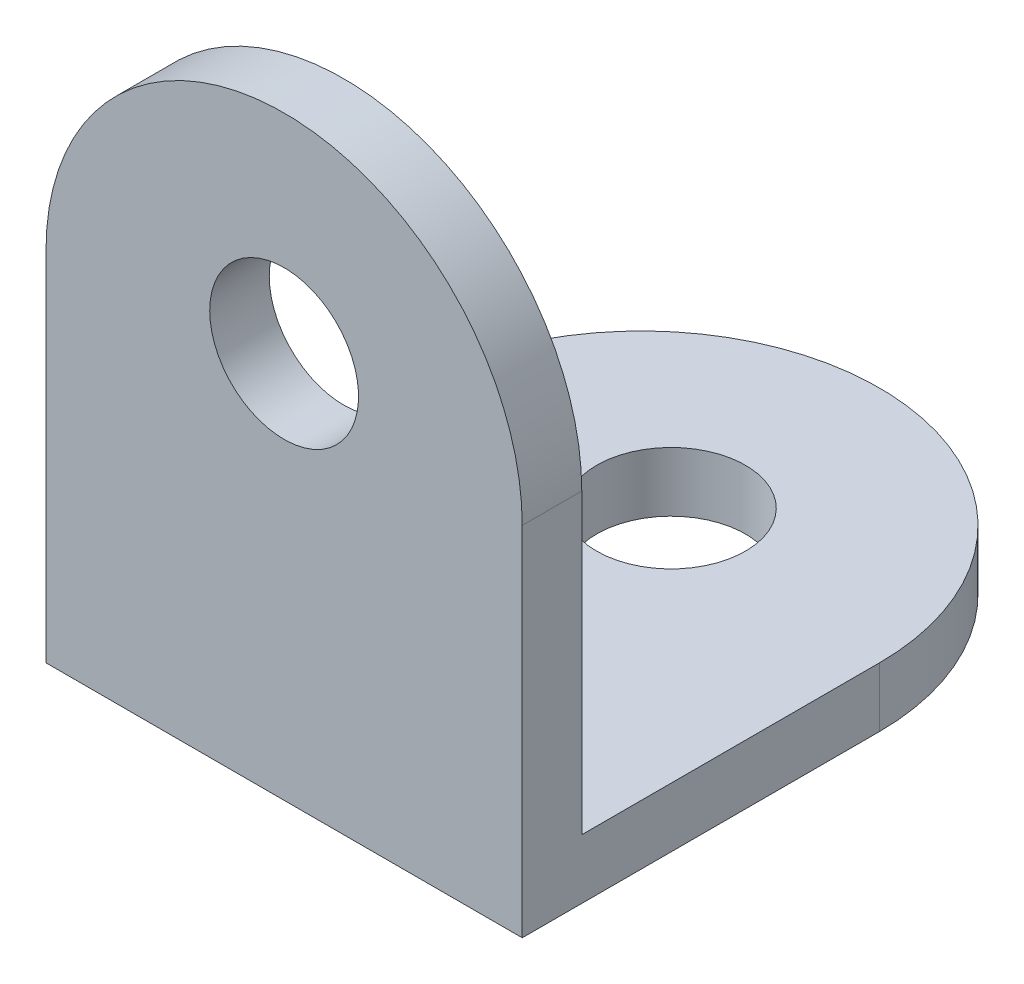
ISO-10303-21;
HEADER;
FILE_DESCRIPTION(('STEP AP214'),'2;1');
FILE_NAME('part.step','',(''),(''),'','','');
FILE_SCHEMA(('AUTOMOTIVE_DESIGN { 1 0 10303 214 1 1 1 1 }'));
ENDSEC;
DATA;
#1=APPLICATION_CONTEXT('core data for automotive mechanical design processes');
#2=APPLICATION_PROTOCOL_DEFINITION('international standard','automotive_design',2000,#1);
#3=PRODUCT_CONTEXT('',#1,'mechanical');
#4=PRODUCT('Part','Part','',(#3));
#5=PRODUCT_RELATED_PRODUCT_CATEGORY('part','',(#4));
#6=PRODUCT_DEFINITION_FORMATION('','',#4);
#7=PRODUCT_DEFINITION_CONTEXT('part definition',#1,'design');
#8=PRODUCT_DEFINITION('design','',#6,#7);
#9=PRODUCT_DEFINITION_SHAPE('','',#8);
#10=(LENGTH_UNIT() NAMED_UNIT(*) SI_UNIT(.MILLI.,.METRE.));
#11=(NAMED_UNIT(*) PLANE_ANGLE_UNIT() SI_UNIT($,.RADIAN.));
#12=(NAMED_UNIT(*) SI_UNIT($,.STERADIAN.) SOLID_ANGLE_UNIT());
#13=UNCERTAINTY_MEASURE_WITH_UNIT(LENGTH_MEASURE(1.E-05),#10,'distance_accuracy_value','');
#14=(GEOMETRIC_REPRESENTATION_CONTEXT(3) GLOBAL_UNCERTAINTY_ASSIGNED_CONTEXT((#13)) GLOBAL_UNIT_ASSIGNED_CONTEXT((#10,
#11,#12)) REPRESENTATION_CONTEXT('',''));
#15=CARTESIAN_POINT('',(0.,0.,0.));
#16=DIRECTION('',(0.,0.,1.));
#17=DIRECTION('',(1.,0.,0.));
#18=AXIS2_PLACEMENT_3D('',#15,#16,#17);
#19=CARTESIAN_POINT('',(0.,2.,-13.4238536666092));
#20=DIRECTION('',(0.,-1.,0.));
#21=DIRECTION('',(0.,0.,-1.));
#22=AXIS2_PLACEMENT_3D('',#19,#20,#21);
#23=CYLINDRICAL_SURFACE('',#22,8.);
#24=CARTESIAN_POINT('',(0.,0.,-13.4238536666092));
#25=DIRECTION('',(0.,1.,0.));
#26=DIRECTION('',(0.,0.,1.));
#27=AXIS2_PLACEMENT_3D('',#24,#25,#26);
#28=CIRCLE('',#27,8.);
#29=CARTESIAN_POINT('',(8.,0.,-13.4238536666092));
#30=VERTEX_POINT('',#29);
#31=CARTESIAN_POINT('',(-8.,0.,-13.4238536666092));
#32=VERTEX_POINT('',#31);
#33=EDGE_CURVE('E101',#30,#32,#28,.T.);
#34=ORIENTED_EDGE('',*,*,#33,.T.);
#35=DIRECTION('',(0.,-1.,0.));
#36=VECTOR('',#35,1.);
#37=CARTESIAN_POINT('',(-8.,2.,-13.4238536666092));
#38=LINE('',#37,#36);
#39=CARTESIAN_POINT('',(-8.,2.,-13.4238536666092));
#40=VERTEX_POINT('',#39);
#41=EDGE_CURVE('E11',#40,#32,#38,.T.);
#42=ORIENTED_EDGE('',*,*,#41,.F.);
#43=CARTESIAN_POINT('',(0.,2.,-13.4238536666092));
#44=DIRECTION('',(0.,1.,0.));
#45=DIRECTION('',(0.,0.,1.));
#46=AXIS2_PLACEMENT_3D('',#43,#44,#45);
#47=CIRCLE('',#46,8.);
#48=CARTESIAN_POINT('',(8.,2.,-13.4238536666092));
#49=VERTEX_POINT('',#48);
#50=EDGE_CURVE('E95',#49,#40,#47,.T.);
#51=ORIENTED_EDGE('',*,*,#50,.F.);
#52=DIRECTION('',(0.,-1.,0.));
#53=VECTOR('',#52,1.);
#54=CARTESIAN_POINT('',(8.,2.,-13.4238536666092));
#55=LINE('',#54,#53);
#56=EDGE_CURVE('E86',#49,#30,#55,.T.);
#57=ORIENTED_EDGE('',*,*,#56,.T.);
#58=EDGE_LOOP('',(#34,#42,#51,#57));
#59=FACE_BOUND('',#58,.T.);
#60=ADVANCED_FACE('F43',(#59),#23,.T.);
#61=CARTESIAN_POINT('',(-8.,2.,-1.42385366660922));
#62=DIRECTION('',(1.,0.,0.));
#63=DIRECTION('',(0.,0.,-1.));
#64=AXIS2_PLACEMENT_3D('',#61,#62,#63);
#65=PLANE('',#64);
#66=DIRECTION('',(0.,0.,1.));
#67=VECTOR('',#66,1.);
#68=CARTESIAN_POINT('',(-8.,0.,-1.42385366660922));
#69=LINE('',#68,#67);
#70=CARTESIAN_POINT('',(-8.,0.,-1.42385366660922));
#71=VERTEX_POINT('',#70);
#72=EDGE_CURVE('E105',#32,#71,#69,.T.);
#73=ORIENTED_EDGE('',*,*,#72,.T.);
#74=DIRECTION('',(0.,-1.,0.));
#75=VECTOR('',#74,1.);
#76=CARTESIAN_POINT('',(-8.,2.,-1.42385366660922));
#77=LINE('',#76,#75);
#78=CARTESIAN_POINT('',(-8.,12.,-1.42385366660922));
#79=VERTEX_POINT('',#78);
#80=EDGE_CURVE('E51',#79,#71,#77,.T.);
#81=ORIENTED_EDGE('',*,*,#80,.F.);
#82=DIRECTION('',(0.,0.,1.));
#83=VECTOR('',#82,1.);
#84=CARTESIAN_POINT('',(-8.,12.,-3.42385366660922));
#85=LINE('',#84,#83);
#86=CARTESIAN_POINT('',(-8.,12.,-3.42385366660922));
#87=VERTEX_POINT('',#86);
#88=EDGE_CURVE('E136',#87,#79,#85,.T.);
#89=ORIENTED_EDGE('',*,*,#88,.F.);
#90=DIRECTION('',(0.,-1.,0.));
#91=VECTOR('',#90,1.);
#92=CARTESIAN_POINT('',(-8.,12.,-3.42385366660922));
#93=LINE('',#92,#91);
#94=CARTESIAN_POINT('',(-8.,2.,-3.42385366660922));
#95=VERTEX_POINT('',#94);
#96=EDGE_CURVE('E113',#87,#95,#93,.T.);
#97=ORIENTED_EDGE('',*,*,#96,.T.);
#98=DIRECTION('',(0.,0.,1.));
#99=VECTOR('',#98,1.);
#100=CARTESIAN_POINT('',(-8.,2.,-1.42385366660922));
#101=LINE('',#100,#99);
#102=EDGE_CURVE('E160',#40,#95,#101,.T.);
#103=ORIENTED_EDGE('',*,*,#102,.F.);
#104=ORIENTED_EDGE('',*,*,#41,.T.);
#105=EDGE_LOOP('',(#73,#81,#89,#97,#103,#104));
#106=FACE_BOUND('',#105,.T.);
#107=ADVANCED_FACE('F133',(#106),#65,.F.);
#108=CARTESIAN_POINT('',(8.,2.,-1.42385366660922));
#109=DIRECTION('',(0.,0.,-1.));
#110=DIRECTION('',(-1.,0.,0.));
#111=AXIS2_PLACEMENT_3D('',#108,#109,#110);
#112=PLANE('',#111);
#113=CARTESIAN_POINT('',(0.,13.,-1.42385366660922));
#114=DIRECTION('',(0.,0.,-1.));
#115=DIRECTION('',(-1.,0.,0.));
#116=AXIS2_PLACEMENT_3D('',#113,#114,#115);
#117=CIRCLE('',#116,2.5);
#118=CARTESIAN_POINT('',(-2.5,13.,-1.42385366660922));
#119=VERTEX_POINT('',#118);
#120=EDGE_CURVE('E181',#119,#119,#117,.T.);
#121=ORIENTED_EDGE('',*,*,#120,.T.);
#122=EDGE_LOOP('',(#121));
#123=FACE_BOUND('',#122,.T.);
#124=DIRECTION('',(1.,0.,0.));
#125=VECTOR('',#124,1.);
#126=CARTESIAN_POINT('',(8.,0.,-1.42385366660922));
#127=LINE('',#126,#125);
#128=CARTESIAN_POINT('',(8.,0.,-1.42385366660922));
#129=VERTEX_POINT('',#128);
#130=EDGE_CURVE('E96',#71,#129,#127,.T.);
#131=ORIENTED_EDGE('',*,*,#130,.T.);
#132=DIRECTION('',(0.,-1.,0.));
#133=VECTOR('',#132,1.);
#134=CARTESIAN_POINT('',(8.,2.,-1.42385366660922));
#135=LINE('',#134,#133);
#136=CARTESIAN_POINT('',(8.,12.,-1.42385366660922));
#137=VERTEX_POINT('',#136);
#138=EDGE_CURVE('E90',#137,#129,#135,.T.);
#139=ORIENTED_EDGE('',*,*,#138,.F.);
#140=CARTESIAN_POINT('',(0.,12.,-1.42385366660922));
#141=DIRECTION('',(0.,0.,-1.));
#142=DIRECTION('',(-1.,0.,0.));
#143=AXIS2_PLACEMENT_3D('',#140,#141,#142);
#144=CIRCLE('',#143,8.);
#145=EDGE_CURVE('E129',#79,#137,#144,.T.);
#146=ORIENTED_EDGE('',*,*,#145,.F.);
#147=ORIENTED_EDGE('',*,*,#80,.T.);
#148=EDGE_LOOP('',(#131,#139,#146,#147));
#149=FACE_BOUND('',#148,.T.);
#150=ADVANCED_FACE('F126',(#123,#149),#112,.F.);
#151=CARTESIAN_POINT('',(8.,2.,-1.42385366660922));
#152=DIRECTION('',(-1.,0.,0.));
#153=DIRECTION('',(0.,0.,1.));
#154=AXIS2_PLACEMENT_3D('',#151,#152,#153);
#155=PLANE('',#154);
#156=DIRECTION('',(0.,0.,-1.));
#157=VECTOR('',#156,1.);
#158=CARTESIAN_POINT('',(8.,0.,-1.42385366660922));
#159=LINE('',#158,#157);
#160=EDGE_CURVE('E83',#129,#30,#159,.T.);
#161=ORIENTED_EDGE('',*,*,#160,.T.);
#162=ORIENTED_EDGE('',*,*,#56,.F.);
#163=DIRECTION('',(0.,0.,-1.));
#164=VECTOR('',#163,1.);
#165=CARTESIAN_POINT('',(8.,2.,-1.42385366660922));
#166=LINE('',#165,#164);
#167=CARTESIAN_POINT('',(8.,2.,-3.42385366660922));
#168=VERTEX_POINT('',#167);
#169=EDGE_CURVE('E63',#168,#49,#166,.T.);
#170=ORIENTED_EDGE('',*,*,#169,.F.);
#171=DIRECTION('',(0.,-1.,0.));
#172=VECTOR('',#171,1.);
#173=CARTESIAN_POINT('',(8.,12.,-3.42385366660922));
#174=LINE('',#173,#172);
#175=CARTESIAN_POINT('',(8.,12.,-3.42385366660922));
#176=VERTEX_POINT('',#175);
#177=EDGE_CURVE('E107',#176,#168,#174,.T.);
#178=ORIENTED_EDGE('',*,*,#177,.F.);
#179=DIRECTION('',(0.,0.,-1.));
#180=VECTOR('',#179,1.);
#181=CARTESIAN_POINT('',(8.,12.,-1.42385366660922));
#182=LINE('',#181,#180);
#183=EDGE_CURVE('E148',#137,#176,#182,.T.);
#184=ORIENTED_EDGE('',*,*,#183,.F.);
#185=ORIENTED_EDGE('',*,*,#138,.T.);
#186=EDGE_LOOP('',(#161,#162,#170,#178,#184,#185));
#187=FACE_BOUND('',#186,.T.);
#188=ADVANCED_FACE('F85',(#187),#155,.F.);
#189=CARTESIAN_POINT('',(0.,2.,-13.4238536666092));
#190=DIRECTION('',(0.,1.,0.));
#191=DIRECTION('',(0.,0.,1.));
#192=AXIS2_PLACEMENT_3D('',#189,#190,#191);
#193=PLANE('',#192);
#194=CARTESIAN_POINT('',(0.,2.,-14.4238536666092));
#195=DIRECTION('',(0.,1.,0.));
#196=DIRECTION('',(0.,0.,1.));
#197=AXIS2_PLACEMENT_3D('',#194,#195,#196);
#198=CIRCLE('',#197,2.5);
#199=CARTESIAN_POINT('',(0.,2.,-11.9238536666092));
#200=VERTEX_POINT('',#199);
#201=EDGE_CURVE('E175',#200,#200,#198,.T.);
#202=ORIENTED_EDGE('',*,*,#201,.F.);
#203=EDGE_LOOP('',(#202));
#204=FACE_BOUND('',#203,.T.);
#205=DIRECTION('',(-1.,0.,0.));
#206=VECTOR('',#205,1.);
#207=CARTESIAN_POINT('',(8.,2.,-3.42385366660922));
#208=LINE('',#207,#206);
#209=EDGE_CURVE('E58',#168,#95,#208,.T.);
#210=ORIENTED_EDGE('',*,*,#209,.F.);
#211=ORIENTED_EDGE('',*,*,#169,.T.);
#212=ORIENTED_EDGE('',*,*,#50,.T.);
#213=ORIENTED_EDGE('',*,*,#102,.T.);
#214=EDGE_LOOP('',(#210,#211,#212,#213));
#215=FACE_BOUND('',#214,.T.);
#216=ADVANCED_FACE('F163',(#204,#215),#193,.T.);
#217=CARTESIAN_POINT('',(0.,0.,-13.4238536666092));
#218=DIRECTION('',(0.,1.,0.));
#219=DIRECTION('',(0.,0.,1.));
#220=AXIS2_PLACEMENT_3D('',#217,#218,#219);
#221=PLANE('',#220);
#222=CARTESIAN_POINT('',(0.,0.,-14.4238536666092));
#223=DIRECTION('',(0.,1.,0.));
#224=DIRECTION('',(0.,0.,1.));
#225=AXIS2_PLACEMENT_3D('',#222,#223,#224);
#226=CIRCLE('',#225,2.5);
#227=CARTESIAN_POINT('',(0.,0.,-11.9238536666092));
#228=VERTEX_POINT('',#227);
#229=EDGE_CURVE('E171',#228,#228,#226,.T.);
#230=ORIENTED_EDGE('',*,*,#229,.T.);
#231=EDGE_LOOP('',(#230));
#232=FACE_BOUND('',#231,.T.);
#233=ORIENTED_EDGE('',*,*,#33,.F.);
#234=ORIENTED_EDGE('',*,*,#160,.F.);
#235=ORIENTED_EDGE('',*,*,#130,.F.);
#236=ORIENTED_EDGE('',*,*,#72,.F.);
#237=EDGE_LOOP('',(#233,#234,#235,#236));
#238=FACE_BOUND('',#237,.T.);
#239=ADVANCED_FACE('F104',(#232,#238),#221,.F.);
#240=CARTESIAN_POINT('',(8.,12.,-3.42385366660922));
#241=DIRECTION('',(0.,0.,1.));
#242=DIRECTION('',(1.,0.,0.));
#243=AXIS2_PLACEMENT_3D('',#240,#241,#242);
#244=PLANE('',#243);
#245=CARTESIAN_POINT('',(0.,13.,-3.42385366660922));
#246=DIRECTION('',(0.,0.,-1.));
#247=DIRECTION('',(-1.,0.,0.));
#248=AXIS2_PLACEMENT_3D('',#245,#246,#247);
#249=CIRCLE('',#248,2.5);
#250=CARTESIAN_POINT('',(-2.5,13.,-3.42385366660922));
#251=VERTEX_POINT('',#250);
#252=EDGE_CURVE('E184',#251,#251,#249,.T.);
#253=ORIENTED_EDGE('',*,*,#252,.F.);
#254=EDGE_LOOP('',(#253));
#255=FACE_BOUND('',#254,.T.);
#256=ORIENTED_EDGE('',*,*,#209,.T.);
#257=ORIENTED_EDGE('',*,*,#96,.F.);
#258=CARTESIAN_POINT('',(0.,12.,-3.42385366660922));
#259=DIRECTION('',(0.,0.,-1.));
#260=DIRECTION('',(-1.,0.,0.));
#261=AXIS2_PLACEMENT_3D('',#258,#259,#260);
#262=CIRCLE('',#261,8.);
#263=EDGE_CURVE('E146',#87,#176,#262,.T.);
#264=ORIENTED_EDGE('',*,*,#263,.T.);
#265=ORIENTED_EDGE('',*,*,#177,.T.);
#266=EDGE_LOOP('',(#256,#257,#264,#265));
#267=FACE_BOUND('',#266,.T.);
#268=ADVANCED_FACE('F165',(#255,#267),#244,.F.);
#269=CARTESIAN_POINT('',(0.,12.,-1.42385366660922));
#270=DIRECTION('',(0.,0.,-1.));
#271=DIRECTION('',(-1.,0.,0.));
#272=AXIS2_PLACEMENT_3D('',#269,#270,#271);
#273=CYLINDRICAL_SURFACE('',#272,8.);
#274=ORIENTED_EDGE('',*,*,#263,.F.);
#275=ORIENTED_EDGE('',*,*,#88,.T.);
#276=ORIENTED_EDGE('',*,*,#145,.T.);
#277=ORIENTED_EDGE('',*,*,#183,.T.);
#278=EDGE_LOOP('',(#274,#275,#276,#277));
#279=FACE_BOUND('',#278,.T.);
#280=ADVANCED_FACE('F143',(#279),#273,.T.);
#281=CARTESIAN_POINT('',(0.,0.,-14.4238536666092));
#282=DIRECTION('',(0.,1.,0.));
#283=DIRECTION('',(0.,0.,1.));
#284=AXIS2_PLACEMENT_3D('',#281,#282,#283);
#285=CYLINDRICAL_SURFACE('',#284,2.5);
#286=ORIENTED_EDGE('',*,*,#229,.F.);
#287=EDGE_LOOP('',(#286));
#288=FACE_BOUND('',#287,.T.);
#289=ORIENTED_EDGE('',*,*,#201,.T.);
#290=EDGE_LOOP('',(#289));
#291=FACE_BOUND('',#290,.T.);
#292=ADVANCED_FACE('F196',(#288,#291),#285,.F.);
#293=CARTESIAN_POINT('',(0.,13.,-1.42385366660922));
#294=DIRECTION('',(0.,0.,-1.));
#295=DIRECTION('',(-1.,0.,0.));
#296=AXIS2_PLACEMENT_3D('',#293,#294,#295);
#297=CYLINDRICAL_SURFACE('',#296,2.5);
#298=ORIENTED_EDGE('',*,*,#120,.F.);
#299=EDGE_LOOP('',(#298));
#300=FACE_BOUND('',#299,.T.);
#301=ORIENTED_EDGE('',*,*,#252,.T.);
#302=EDGE_LOOP('',(#301));
#303=FACE_BOUND('',#302,.T.);
#304=ADVANCED_FACE('F193',(#300,#303),#297,.F.);
#305=CLOSED_SHELL('',(#60,#107,#150,#188,#216,#239,#268,#280,#292,#304));
#306=MANIFOLD_SOLID_BREP('B2',#305);
#307=ADVANCED_BREP_SHAPE_REPRESENTATION('',(#18,#306),#14);
#308=SHAPE_DEFINITION_REPRESENTATION(#9,#307);
ENDSEC;
END-ISO-10303-21;
